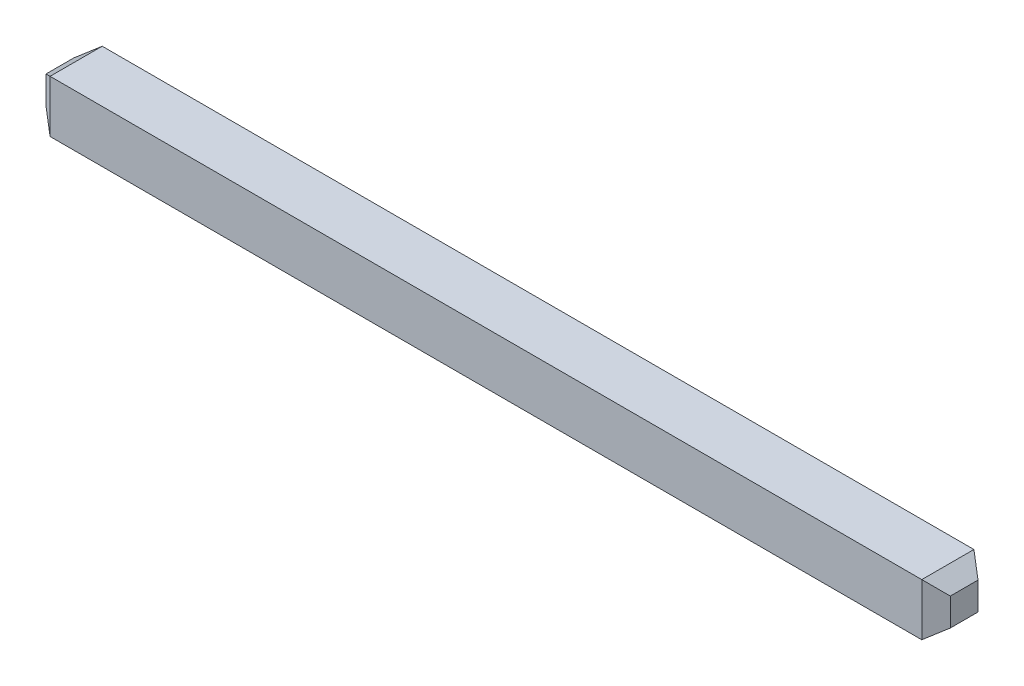
ISO-10303-21;
HEADER;
FILE_DESCRIPTION(('STEP AP214'),'2;1');
FILE_NAME('part.step','',(''),(''),'','','');
FILE_SCHEMA(('AUTOMOTIVE_DESIGN { 1 0 10303 214 1 1 1 1 }'));
ENDSEC;
DATA;
#1=APPLICATION_CONTEXT('core data for automotive mechanical design processes');
#2=APPLICATION_PROTOCOL_DEFINITION('international standard','automotive_design',2000,#1);
#3=PRODUCT_CONTEXT('',#1,'mechanical');
#4=PRODUCT('Part','Part','',(#3));
#5=PRODUCT_RELATED_PRODUCT_CATEGORY('part','',(#4));
#6=PRODUCT_DEFINITION_FORMATION('','',#4);
#7=PRODUCT_DEFINITION_CONTEXT('part definition',#1,'design');
#8=PRODUCT_DEFINITION('design','',#6,#7);
#9=PRODUCT_DEFINITION_SHAPE('','',#8);
#10=(LENGTH_UNIT() NAMED_UNIT(*) SI_UNIT(.MILLI.,.METRE.));
#11=(NAMED_UNIT(*) PLANE_ANGLE_UNIT() SI_UNIT($,.RADIAN.));
#12=(NAMED_UNIT(*) SI_UNIT($,.STERADIAN.) SOLID_ANGLE_UNIT());
#13=UNCERTAINTY_MEASURE_WITH_UNIT(LENGTH_MEASURE(1.E-05),#10,'distance_accuracy_value','');
#14=(GEOMETRIC_REPRESENTATION_CONTEXT(3) GLOBAL_UNCERTAINTY_ASSIGNED_CONTEXT((#13)) GLOBAL_UNIT_ASSIGNED_CONTEXT((#10,
#11,#12)) REPRESENTATION_CONTEXT('',''));
#15=CARTESIAN_POINT('',(0.,0.,0.));
#16=DIRECTION('',(0.,0.,1.));
#17=DIRECTION('',(1.,0.,0.));
#18=AXIS2_PLACEMENT_3D('',#15,#16,#17);
#19=CARTESIAN_POINT('',(-2.4,3.77,-14.215));
#20=DIRECTION('',(0.599999999990736,0.,0.800000000006948));
#21=DIRECTION('',(0.800000000006948,0.,-0.599999999990736));
#22=AXIS2_PLACEMENT_3D('',#19,#20,#21);
#23=PLANE('',#22);
#24=DIRECTION('',(0.,1.,0.));
#25=VECTOR('',#24,1.);
#26=CARTESIAN_POINT('',(-2.3,3.77,-14.29));
#27=LINE('',#26,#25);
#28=CARTESIAN_POINT('',(-2.29999999999957,4.09,-14.2899999999994));
#29=VERTEX_POINT('',#28);
#30=CARTESIAN_POINT('',(-2.29999999999957,3.45,-14.2899999999994));
#31=VERTEX_POINT('',#30);
#32=EDGE_CURVE('E101',#29,#31,#27,.F.);
#33=ORIENTED_EDGE('',*,*,#32,.T.);
#34=DIRECTION('',(-0.685994340570039,0.514495755427529,0.51449575542752));
#35=VECTOR('',#34,1.);
#36=CARTESIAN_POINT('',(-2.3,3.45,-14.29));
#37=LINE('',#36,#35);
#38=CARTESIAN_POINT('',(-2.50000000000022,3.6,-14.1400000000003));
#39=VERTEX_POINT('',#38);
#40=EDGE_CURVE('E85',#31,#39,#37,.T.);
#41=ORIENTED_EDGE('',*,*,#40,.T.);
#42=DIRECTION('',(0.,1.,0.));
#43=VECTOR('',#42,1.);
#44=CARTESIAN_POINT('',(-2.5,3.77,-14.14));
#45=LINE('',#44,#43);
#46=CARTESIAN_POINT('',(-2.50000000000043,3.94,-14.1400000000006));
#47=VERTEX_POINT('',#46);
#48=EDGE_CURVE('E79',#39,#47,#45,.T.);
#49=ORIENTED_EDGE('',*,*,#48,.T.);
#50=DIRECTION('',(-0.685994340570039,-0.514495755427529,0.51449575542752));
#51=VECTOR('',#50,1.);
#52=CARTESIAN_POINT('',(-2.3,4.09,-14.29));
#53=LINE('',#52,#51);
#54=EDGE_CURVE('E20',#29,#47,#53,.T.);
#55=ORIENTED_EDGE('',*,*,#54,.F.);
#56=EDGE_LOOP('',(#33,#41,#49,#55));
#57=FACE_BOUND('',#56,.T.);
#58=ADVANCED_FACE('F17',(#57),#23,.F.);
#59=CARTESIAN_POINT('',(8.5,3.77,-14.215));
#60=DIRECTION('',(-0.599999999990736,0.,0.800000000006948));
#61=DIRECTION('',(0.800000000006948,0.,0.599999999990736));
#62=AXIS2_PLACEMENT_3D('',#59,#60,#61);
#63=PLANE('',#62);
#64=DIRECTION('',(0.,1.,0.));
#65=VECTOR('',#64,1.);
#66=CARTESIAN_POINT('',(8.6,3.77,-14.14));
#67=LINE('',#66,#65);
#68=CARTESIAN_POINT('',(8.60000000000022,3.6,-14.1400000000003));
#69=VERTEX_POINT('',#68);
#70=CARTESIAN_POINT('',(8.60000000000043,3.94,-14.1400000000006));
#71=VERTEX_POINT('',#70);
#72=EDGE_CURVE('E113',#69,#71,#67,.T.);
#73=ORIENTED_EDGE('',*,*,#72,.F.);
#74=DIRECTION('',(-0.685994340570037,-0.514495755427528,-0.514495755427522));
#75=VECTOR('',#74,1.);
#76=CARTESIAN_POINT('',(8.6,3.6,-14.14));
#77=LINE('',#76,#75);
#78=CARTESIAN_POINT('',(8.39999999999957,3.45,-14.2899999999994));
#79=VERTEX_POINT('',#78);
#80=EDGE_CURVE('E108',#69,#79,#77,.T.);
#81=ORIENTED_EDGE('',*,*,#80,.T.);
#82=DIRECTION('',(0.,1.,0.));
#83=VECTOR('',#82,1.);
#84=CARTESIAN_POINT('',(8.4,3.77,-14.29));
#85=LINE('',#84,#83);
#86=CARTESIAN_POINT('',(8.39999999999957,4.09,-14.2899999999994));
#87=VERTEX_POINT('',#86);
#88=EDGE_CURVE('E99',#79,#87,#85,.T.);
#89=ORIENTED_EDGE('',*,*,#88,.T.);
#90=DIRECTION('',(-0.685994340570037,0.514495755427528,-0.514495755427522));
#91=VECTOR('',#90,1.);
#92=CARTESIAN_POINT('',(8.6,3.94,-14.14));
#93=LINE('',#92,#91);
#94=EDGE_CURVE('E116',#71,#87,#93,.T.);
#95=ORIENTED_EDGE('',*,*,#94,.F.);
#96=EDGE_LOOP('',(#73,#81,#89,#95));
#97=FACE_BOUND('',#96,.T.);
#98=ADVANCED_FACE('F214',(#97),#63,.F.);
#99=CARTESIAN_POINT('',(-2.4,4.015,-13.97));
#100=DIRECTION('',(-0.6,0.8,0.));
#101=DIRECTION('',(-0.8,-0.6,0.));
#102=AXIS2_PLACEMENT_3D('',#99,#100,#101);
#103=PLANE('',#102);
#104=DIRECTION('',(-0.685994340575993,-0.514495755427525,-0.514495755419585));
#105=VECTOR('',#104,1.);
#106=CARTESIAN_POINT('',(-2.29999999999913,4.09,-13.6500000000012));
#107=LINE('',#106,#105);
#108=CARTESIAN_POINT('',(-2.29999999999989,4.09,-13.6500000000001));
#109=VERTEX_POINT('',#108);
#110=CARTESIAN_POINT('',(-2.50000000000022,3.94,-13.7999999999997));
#111=VERTEX_POINT('',#110);
#112=EDGE_CURVE('E128',#109,#111,#107,.T.);
#113=ORIENTED_EDGE('',*,*,#112,.F.);
#114=DIRECTION('',(0.,0.,1.));
#115=VECTOR('',#114,1.);
#116=CARTESIAN_POINT('',(-2.3,4.09,-13.97));
#117=LINE('',#116,#115);
#118=EDGE_CURVE('E93',#29,#109,#117,.T.);
#119=ORIENTED_EDGE('',*,*,#118,.F.);
#120=ORIENTED_EDGE('',*,*,#54,.T.);
#121=DIRECTION('',(0.,0.,-1.));
#122=VECTOR('',#121,1.);
#123=CARTESIAN_POINT('',(-2.5,3.94,-13.97));
#124=LINE('',#123,#122);
#125=EDGE_CURVE('E87',#47,#111,#124,.F.);
#126=ORIENTED_EDGE('',*,*,#125,.T.);
#127=EDGE_LOOP('',(#113,#119,#120,#126));
#128=FACE_BOUND('',#127,.T.);
#129=ADVANCED_FACE('F90',(#128),#103,.T.);
#130=CARTESIAN_POINT('',(-2.5,3.77,-13.97));
#131=DIRECTION('',(1.,0.,0.));
#132=DIRECTION('',(0.,0.,-1.));
#133=AXIS2_PLACEMENT_3D('',#130,#131,#132);
#134=PLANE('',#133);
#135=DIRECTION('',(0.,1.,0.));
#136=VECTOR('',#135,1.);
#137=CARTESIAN_POINT('',(-2.50000000000087,3.77,-13.7999999999988));
#138=LINE('',#137,#136);
#139=CARTESIAN_POINT('',(-2.50000000000022,3.6,-13.7999999999997));
#140=VERTEX_POINT('',#139);
#141=EDGE_CURVE('E97',#111,#140,#138,.F.);
#142=ORIENTED_EDGE('',*,*,#141,.F.);
#143=ORIENTED_EDGE('',*,*,#125,.F.);
#144=ORIENTED_EDGE('',*,*,#48,.F.);
#145=DIRECTION('',(0.,0.,1.));
#146=VECTOR('',#145,1.);
#147=CARTESIAN_POINT('',(-2.5,3.6,-13.97));
#148=LINE('',#147,#146);
#149=EDGE_CURVE('E105',#39,#140,#148,.T.);
#150=ORIENTED_EDGE('',*,*,#149,.T.);
#151=EDGE_LOOP('',(#142,#143,#144,#150));
#152=FACE_BOUND('',#151,.T.);
#153=ADVANCED_FACE('F95',(#152),#134,.F.);
#154=CARTESIAN_POINT('',(3.05,3.77,-14.29));
#155=DIRECTION('',(0.,0.,1.));
#156=DIRECTION('',(1.,0.,0.));
#157=AXIS2_PLACEMENT_3D('',#154,#155,#156);
#158=PLANE('',#157);
#159=ORIENTED_EDGE('',*,*,#32,.F.);
#160=DIRECTION('',(1.,0.,0.));
#161=VECTOR('',#160,1.);
#162=CARTESIAN_POINT('',(3.05,4.09,-14.29));
#163=LINE('',#162,#161);
#164=EDGE_CURVE('E122',#87,#29,#163,.F.);
#165=ORIENTED_EDGE('',*,*,#164,.F.);
#166=ORIENTED_EDGE('',*,*,#88,.F.);
#167=DIRECTION('',(1.,0.,0.));
#168=VECTOR('',#167,1.);
#169=CARTESIAN_POINT('',(3.05,3.45,-14.29));
#170=LINE('',#169,#168);
#171=EDGE_CURVE('E136',#79,#31,#170,.F.);
#172=ORIENTED_EDGE('',*,*,#171,.T.);
#173=EDGE_LOOP('',(#159,#165,#166,#172));
#174=FACE_BOUND('',#173,.T.);
#175=ADVANCED_FACE('F182',(#174),#158,.F.);
#176=CARTESIAN_POINT('',(-2.4,3.525,-13.97));
#177=DIRECTION('',(0.6,0.8,0.));
#178=DIRECTION('',(-0.8,0.6,0.));
#179=AXIS2_PLACEMENT_3D('',#176,#177,#178);
#180=PLANE('',#179);
#181=DIRECTION('',(0.,0.,1.));
#182=VECTOR('',#181,1.);
#183=CARTESIAN_POINT('',(-2.3,3.45,-13.97));
#184=LINE('',#183,#182);
#185=CARTESIAN_POINT('',(-2.29999999999978,3.45,-13.6500000000003));
#186=VERTEX_POINT('',#185);
#187=EDGE_CURVE('E139',#31,#186,#184,.T.);
#188=ORIENTED_EDGE('',*,*,#187,.T.);
#189=DIRECTION('',(0.685994340575993,-0.514495755427525,0.514495755419585));
#190=VECTOR('',#189,1.);
#191=CARTESIAN_POINT('',(-2.50000000000087,3.6,-13.7999999999988));
#192=LINE('',#191,#190);
#193=EDGE_CURVE('E131',#140,#186,#192,.T.);
#194=ORIENTED_EDGE('',*,*,#193,.F.);
#195=ORIENTED_EDGE('',*,*,#149,.F.);
#196=ORIENTED_EDGE('',*,*,#40,.F.);
#197=EDGE_LOOP('',(#188,#194,#195,#196));
#198=FACE_BOUND('',#197,.T.);
#199=ADVANCED_FACE('F179',(#198),#180,.F.);
#200=CARTESIAN_POINT('',(8.5,3.525,-13.97));
#201=DIRECTION('',(-0.6,0.8,0.));
#202=DIRECTION('',(-0.8,-0.6,0.));
#203=AXIS2_PLACEMENT_3D('',#200,#201,#202);
#204=PLANE('',#203);
#205=DIRECTION('',(0.,0.,-1.));
#206=VECTOR('',#205,1.);
#207=CARTESIAN_POINT('',(8.6,3.6,-13.97));
#208=LINE('',#207,#206);
#209=CARTESIAN_POINT('',(8.60000000000022,3.6,-13.7999999999997));
#210=VERTEX_POINT('',#209);
#211=EDGE_CURVE('E110',#210,#69,#208,.T.);
#212=ORIENTED_EDGE('',*,*,#211,.F.);
#213=DIRECTION('',(0.685994340575991,0.514495755427529,-0.514495755419583));
#214=VECTOR('',#213,1.);
#215=CARTESIAN_POINT('',(8.39999999999913,3.45,-13.6500000000012));
#216=LINE('',#215,#214);
#217=CARTESIAN_POINT('',(8.39999999999989,3.45,-13.6500000000001));
#218=VERTEX_POINT('',#217);
#219=EDGE_CURVE('E35',#218,#210,#216,.T.);
#220=ORIENTED_EDGE('',*,*,#219,.F.);
#221=DIRECTION('',(0.,0.,1.));
#222=VECTOR('',#221,1.);
#223=CARTESIAN_POINT('',(8.4,3.45,-13.97));
#224=LINE('',#223,#222);
#225=EDGE_CURVE('E134',#218,#79,#224,.F.);
#226=ORIENTED_EDGE('',*,*,#225,.T.);
#227=ORIENTED_EDGE('',*,*,#80,.F.);
#228=EDGE_LOOP('',(#212,#220,#226,#227));
#229=FACE_BOUND('',#228,.T.);
#230=ADVANCED_FACE('F181',(#229),#204,.F.);
#231=CARTESIAN_POINT('',(8.6,3.77,-13.97));
#232=DIRECTION('',(1.,0.,0.));
#233=DIRECTION('',(0.,0.,-1.));
#234=AXIS2_PLACEMENT_3D('',#231,#232,#233);
#235=PLANE('',#234);
#236=ORIENTED_EDGE('',*,*,#72,.T.);
#237=DIRECTION('',(0.,0.,1.));
#238=VECTOR('',#237,1.);
#239=CARTESIAN_POINT('',(8.6,3.94,-13.97));
#240=LINE('',#239,#238);
#241=CARTESIAN_POINT('',(8.60000000000022,3.94,-13.7999999999997));
#242=VERTEX_POINT('',#241);
#243=EDGE_CURVE('E119',#242,#71,#240,.F.);
#244=ORIENTED_EDGE('',*,*,#243,.F.);
#245=DIRECTION('',(0.,1.,0.));
#246=VECTOR('',#245,1.);
#247=CARTESIAN_POINT('',(8.60000000000087,3.77,-13.7999999999988));
#248=LINE('',#247,#246);
#249=EDGE_CURVE('E142',#210,#242,#248,.T.);
#250=ORIENTED_EDGE('',*,*,#249,.F.);
#251=ORIENTED_EDGE('',*,*,#211,.T.);
#252=EDGE_LOOP('',(#236,#244,#250,#251));
#253=FACE_BOUND('',#252,.T.);
#254=ADVANCED_FACE('F189',(#253),#235,.T.);
#255=CARTESIAN_POINT('',(8.5,4.015,-13.97));
#256=DIRECTION('',(0.6,0.8,0.));
#257=DIRECTION('',(-0.8,0.6,0.));
#258=AXIS2_PLACEMENT_3D('',#255,#256,#257);
#259=PLANE('',#258);
#260=DIRECTION('',(-0.685994340575991,0.514495755427529,0.514495755419583));
#261=VECTOR('',#260,1.);
#262=CARTESIAN_POINT('',(8.60000000000087,3.94,-13.7999999999988));
#263=LINE('',#262,#261);
#264=CARTESIAN_POINT('',(8.39999999999989,4.09,-13.6500000000001));
#265=VERTEX_POINT('',#264);
#266=EDGE_CURVE('E145',#242,#265,#263,.T.);
#267=ORIENTED_EDGE('',*,*,#266,.F.);
#268=ORIENTED_EDGE('',*,*,#243,.T.);
#269=ORIENTED_EDGE('',*,*,#94,.T.);
#270=DIRECTION('',(0.,0.,1.));
#271=VECTOR('',#270,1.);
#272=CARTESIAN_POINT('',(8.4,4.09,-13.97));
#273=LINE('',#272,#271);
#274=EDGE_CURVE('E125',#265,#87,#273,.F.);
#275=ORIENTED_EDGE('',*,*,#274,.F.);
#276=EDGE_LOOP('',(#267,#268,#269,#275));
#277=FACE_BOUND('',#276,.T.);
#278=ADVANCED_FACE('F170',(#277),#259,.T.);
#279=CARTESIAN_POINT('',(3.05,4.09,-13.97));
#280=DIRECTION('',(0.,1.,0.));
#281=DIRECTION('',(0.,0.,1.));
#282=AXIS2_PLACEMENT_3D('',#279,#280,#281);
#283=PLANE('',#282);
#284=DIRECTION('',(1.,0.,0.));
#285=VECTOR('',#284,1.);
#286=CARTESIAN_POINT('',(3.05,4.09,-13.65));
#287=LINE('',#286,#285);
#288=EDGE_CURVE('E148',#265,#109,#287,.F.);
#289=ORIENTED_EDGE('',*,*,#288,.F.);
#290=ORIENTED_EDGE('',*,*,#274,.T.);
#291=ORIENTED_EDGE('',*,*,#164,.T.);
#292=ORIENTED_EDGE('',*,*,#118,.T.);
#293=EDGE_LOOP('',(#289,#290,#291,#292));
#294=FACE_BOUND('',#293,.T.);
#295=ADVANCED_FACE('F173',(#294),#283,.T.);
#296=CARTESIAN_POINT('',(-2.4,3.77,-13.725));
#297=DIRECTION('',(-0.599999999990736,0.,0.800000000006948));
#298=DIRECTION('',(0.800000000006948,0.,0.599999999990736));
#299=AXIS2_PLACEMENT_3D('',#296,#297,#298);
#300=PLANE('',#299);
#301=ORIENTED_EDGE('',*,*,#193,.T.);
#302=DIRECTION('',(0.,1.,0.));
#303=VECTOR('',#302,1.);
#304=CARTESIAN_POINT('',(-2.3,3.77,-13.65));
#305=LINE('',#304,#303);
#306=EDGE_CURVE('E151',#109,#186,#305,.F.);
#307=ORIENTED_EDGE('',*,*,#306,.F.);
#308=ORIENTED_EDGE('',*,*,#112,.T.);
#309=ORIENTED_EDGE('',*,*,#141,.T.);
#310=EDGE_LOOP('',(#301,#307,#308,#309));
#311=FACE_BOUND('',#310,.T.);
#312=ADVANCED_FACE('F176',(#311),#300,.T.);
#313=CARTESIAN_POINT('',(3.05,3.45,-13.97));
#314=DIRECTION('',(0.,1.,0.));
#315=DIRECTION('',(0.,0.,1.));
#316=AXIS2_PLACEMENT_3D('',#313,#314,#315);
#317=PLANE('',#316);
#318=ORIENTED_EDGE('',*,*,#187,.F.);
#319=ORIENTED_EDGE('',*,*,#171,.F.);
#320=ORIENTED_EDGE('',*,*,#225,.F.);
#321=DIRECTION('',(1.,0.,0.));
#322=VECTOR('',#321,1.);
#323=CARTESIAN_POINT('',(3.05,3.45,-13.65));
#324=LINE('',#323,#322);
#325=EDGE_CURVE('E26',#186,#218,#324,.T.);
#326=ORIENTED_EDGE('',*,*,#325,.F.);
#327=EDGE_LOOP('',(#318,#319,#320,#326));
#328=FACE_BOUND('',#327,.T.);
#329=ADVANCED_FACE('F162',(#328),#317,.F.);
#330=CARTESIAN_POINT('',(8.5,3.77,-13.725));
#331=DIRECTION('',(0.599999999990736,0.,0.800000000006948));
#332=DIRECTION('',(0.800000000006948,0.,-0.599999999990736));
#333=AXIS2_PLACEMENT_3D('',#330,#331,#332);
#334=PLANE('',#333);
#335=ORIENTED_EDGE('',*,*,#266,.T.);
#336=DIRECTION('',(0.,1.,0.));
#337=VECTOR('',#336,1.);
#338=CARTESIAN_POINT('',(8.4,3.77,-13.65));
#339=LINE('',#338,#337);
#340=EDGE_CURVE('E11',#218,#265,#339,.T.);
#341=ORIENTED_EDGE('',*,*,#340,.F.);
#342=ORIENTED_EDGE('',*,*,#219,.T.);
#343=ORIENTED_EDGE('',*,*,#249,.T.);
#344=EDGE_LOOP('',(#335,#341,#342,#343));
#345=FACE_BOUND('',#344,.T.);
#346=ADVANCED_FACE('F166',(#345),#334,.T.);
#347=CARTESIAN_POINT('',(3.05,3.77,-13.65));
#348=DIRECTION('',(0.,0.,1.));
#349=DIRECTION('',(1.,0.,0.));
#350=AXIS2_PLACEMENT_3D('',#347,#348,#349);
#351=PLANE('',#350);
#352=ORIENTED_EDGE('',*,*,#325,.T.);
#353=ORIENTED_EDGE('',*,*,#340,.T.);
#354=ORIENTED_EDGE('',*,*,#288,.T.);
#355=ORIENTED_EDGE('',*,*,#306,.T.);
#356=EDGE_LOOP('',(#352,#353,#354,#355));
#357=FACE_BOUND('',#356,.T.);
#358=ADVANCED_FACE('F157',(#357),#351,.T.);
#359=CLOSED_SHELL('',(#58,#98,#129,#153,#175,#199,#230,#254,#278,#295,#312,#329,#346,#358));
#360=MANIFOLD_SOLID_BREP('B1',#359);
#361=ADVANCED_BREP_SHAPE_REPRESENTATION('',(#18,#360),#14);
#362=SHAPE_DEFINITION_REPRESENTATION(#9,#361);
ENDSEC;
END-ISO-10303-21;
